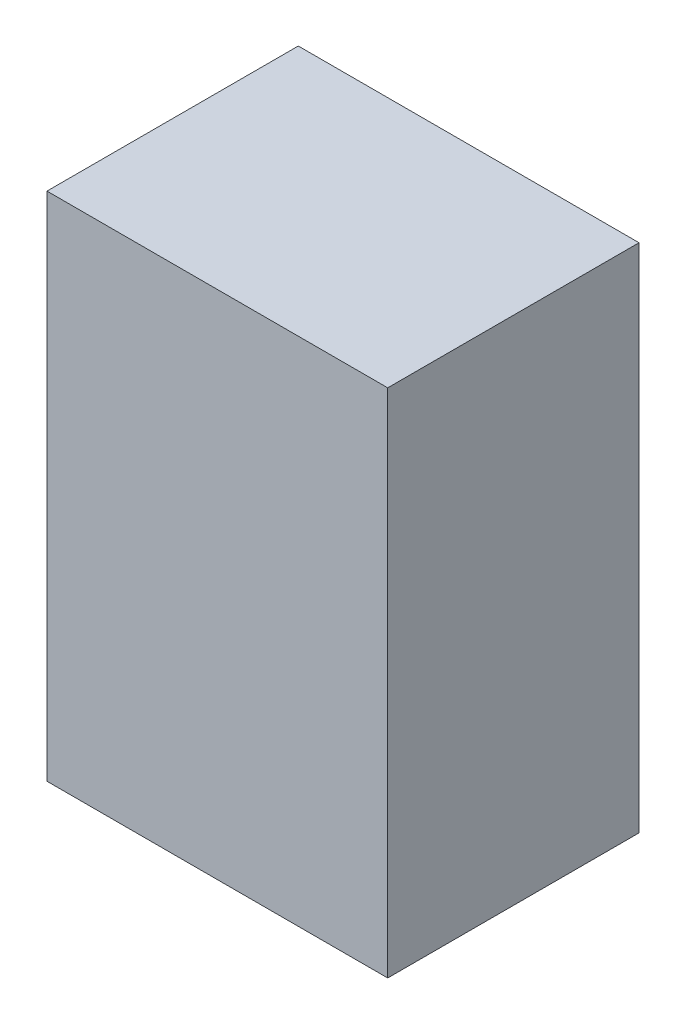
ISO-10303-21;
HEADER;
FILE_DESCRIPTION(('STEP AP214'),'2;1');
FILE_NAME('part.step','',(''),(''),'','','');
FILE_SCHEMA(('AUTOMOTIVE_DESIGN { 1 0 10303 214 1 1 1 1 }'));
ENDSEC;
DATA;
#1=APPLICATION_CONTEXT('core data for automotive mechanical design processes');
#2=APPLICATION_PROTOCOL_DEFINITION('international standard','automotive_design',2000,#1);
#3=PRODUCT_CONTEXT('',#1,'mechanical');
#4=PRODUCT('Part','Part','',(#3));
#5=PRODUCT_RELATED_PRODUCT_CATEGORY('part','',(#4));
#6=PRODUCT_DEFINITION_FORMATION('','',#4);
#7=PRODUCT_DEFINITION_CONTEXT('part definition',#1,'design');
#8=PRODUCT_DEFINITION('design','',#6,#7);
#9=PRODUCT_DEFINITION_SHAPE('','',#8);
#10=(LENGTH_UNIT() NAMED_UNIT(*) SI_UNIT(.MILLI.,.METRE.));
#11=(NAMED_UNIT(*) PLANE_ANGLE_UNIT() SI_UNIT($,.RADIAN.));
#12=(NAMED_UNIT(*) SI_UNIT($,.STERADIAN.) SOLID_ANGLE_UNIT());
#13=UNCERTAINTY_MEASURE_WITH_UNIT(LENGTH_MEASURE(1.E-05),#10,'distance_accuracy_value','');
#14=(GEOMETRIC_REPRESENTATION_CONTEXT(3) GLOBAL_UNCERTAINTY_ASSIGNED_CONTEXT((#13)) GLOBAL_UNIT_ASSIGNED_CONTEXT((#10,
#11,#12)) REPRESENTATION_CONTEXT('',''));
#15=CARTESIAN_POINT('',(0.,0.,0.));
#16=DIRECTION('',(0.,0.,1.));
#17=DIRECTION('',(1.,0.,0.));
#18=AXIS2_PLACEMENT_3D('',#15,#16,#17);
#19=CARTESIAN_POINT('',(-0.3999992,-0.5999988,0.58999882));
#20=DIRECTION('',(0.,0.,-1.));
#21=DIRECTION('',(-1.,0.,0.));
#22=AXIS2_PLACEMENT_3D('',#19,#20,#21);
#23=PLANE('',#22);
#24=DIRECTION('',(0.,1.,0.));
#25=VECTOR('',#24,1.);
#26=CARTESIAN_POINT('',(0.3999992,-0.5999988,0.58999882));
#27=LINE('',#26,#25);
#28=CARTESIAN_POINT('',(0.3999992,-0.5999988,0.58999882));
#29=VERTEX_POINT('',#28);
#30=CARTESIAN_POINT('',(0.3999992,0.60000134,0.58999882));
#31=VERTEX_POINT('',#30);
#32=EDGE_CURVE('E55',#29,#31,#27,.T.);
#33=ORIENTED_EDGE('',*,*,#32,.T.);
#34=DIRECTION('',(1.,0.,0.));
#35=VECTOR('',#34,1.);
#36=CARTESIAN_POINT('',(0.3999992,0.60000134,0.58999882));
#37=LINE('',#36,#35);
#38=CARTESIAN_POINT('',(-0.3999992,0.60000134,0.58999882));
#39=VERTEX_POINT('',#38);
#40=EDGE_CURVE('E57',#31,#39,#37,.F.);
#41=ORIENTED_EDGE('',*,*,#40,.T.);
#42=DIRECTION('',(0.,1.,0.));
#43=VECTOR('',#42,1.);
#44=CARTESIAN_POINT('',(-0.3999992,0.60000134,0.58999882));
#45=LINE('',#44,#43);
#46=CARTESIAN_POINT('',(-0.3999992,-0.5999988,0.58999882));
#47=VERTEX_POINT('',#46);
#48=EDGE_CURVE('E20',#39,#47,#45,.F.);
#49=ORIENTED_EDGE('',*,*,#48,.T.);
#50=DIRECTION('',(1.,0.,0.));
#51=VECTOR('',#50,1.);
#52=CARTESIAN_POINT('',(-0.3999992,-0.5999988,0.58999882));
#53=LINE('',#52,#51);
#54=EDGE_CURVE('E80',#47,#29,#53,.T.);
#55=ORIENTED_EDGE('',*,*,#54,.T.);
#56=EDGE_LOOP('',(#33,#41,#49,#55));
#57=FACE_BOUND('',#56,.T.);
#58=ADVANCED_FACE('F17',(#57),#23,.F.);
#59=CARTESIAN_POINT('',(-0.3999992,0.60000134,0.));
#60=DIRECTION('',(1.,0.,0.));
#61=DIRECTION('',(0.,0.,-1.));
#62=AXIS2_PLACEMENT_3D('',#59,#60,#61);
#63=PLANE('',#62);
#64=DIRECTION('',(0.,0.,1.));
#65=VECTOR('',#64,1.);
#66=CARTESIAN_POINT('',(-0.3999992,-0.5999988,0.));
#67=LINE('',#66,#65);
#68=CARTESIAN_POINT('',(-0.3999992,-0.5999988,0.));
#69=VERTEX_POINT('',#68);
#70=EDGE_CURVE('E68',#69,#47,#67,.T.);
#71=ORIENTED_EDGE('',*,*,#70,.T.);
#72=ORIENTED_EDGE('',*,*,#48,.F.);
#73=DIRECTION('',(0.,0.,-1.));
#74=VECTOR('',#73,1.);
#75=CARTESIAN_POINT('',(-0.3999992,0.60000134,0.));
#76=LINE('',#75,#74);
#77=CARTESIAN_POINT('',(-0.3999992,0.60000134,0.));
#78=VERTEX_POINT('',#77);
#79=EDGE_CURVE('E63',#39,#78,#76,.T.);
#80=ORIENTED_EDGE('',*,*,#79,.T.);
#81=DIRECTION('',(0.,1.,0.));
#82=VECTOR('',#81,1.);
#83=CARTESIAN_POINT('',(-0.3999992,-0.5999988,0.));
#84=LINE('',#83,#82);
#85=EDGE_CURVE('E83',#69,#78,#84,.T.);
#86=ORIENTED_EDGE('',*,*,#85,.F.);
#87=EDGE_LOOP('',(#71,#72,#80,#86));
#88=FACE_BOUND('',#87,.T.);
#89=ADVANCED_FACE('F65',(#88),#63,.F.);
#90=CARTESIAN_POINT('',(0.3999992,0.60000134,0.));
#91=DIRECTION('',(0.,-1.,0.));
#92=DIRECTION('',(0.,0.,-1.));
#93=AXIS2_PLACEMENT_3D('',#90,#91,#92);
#94=PLANE('',#93);
#95=ORIENTED_EDGE('',*,*,#79,.F.);
#96=ORIENTED_EDGE('',*,*,#40,.F.);
#97=DIRECTION('',(0.,0.,1.));
#98=VECTOR('',#97,1.);
#99=CARTESIAN_POINT('',(0.3999992,0.60000134,0.));
#100=LINE('',#99,#98);
#101=CARTESIAN_POINT('',(0.3999992,0.60000134,0.));
#102=VERTEX_POINT('',#101);
#103=EDGE_CURVE('E75',#31,#102,#100,.F.);
#104=ORIENTED_EDGE('',*,*,#103,.T.);
#105=DIRECTION('',(-1.,0.,0.));
#106=VECTOR('',#105,1.);
#107=CARTESIAN_POINT('',(-0.3999992,0.60000134,0.));
#108=LINE('',#107,#106);
#109=EDGE_CURVE('E72',#78,#102,#108,.F.);
#110=ORIENTED_EDGE('',*,*,#109,.F.);
#111=EDGE_LOOP('',(#95,#96,#104,#110));
#112=FACE_BOUND('',#111,.T.);
#113=ADVANCED_FACE('F70',(#112),#94,.F.);
#114=CARTESIAN_POINT('',(0.3999992,-0.5999988,0.));
#115=DIRECTION('',(-1.,0.,0.));
#116=DIRECTION('',(0.,0.,1.));
#117=AXIS2_PLACEMENT_3D('',#114,#115,#116);
#118=PLANE('',#117);
#119=ORIENTED_EDGE('',*,*,#103,.F.);
#120=ORIENTED_EDGE('',*,*,#32,.F.);
#121=DIRECTION('',(0.,0.,1.));
#122=VECTOR('',#121,1.);
#123=CARTESIAN_POINT('',(0.3999992,-0.5999988,0.));
#124=LINE('',#123,#122);
#125=CARTESIAN_POINT('',(0.3999992,-0.5999988,0.));
#126=VERTEX_POINT('',#125);
#127=EDGE_CURVE('E35',#29,#126,#124,.F.);
#128=ORIENTED_EDGE('',*,*,#127,.T.);
#129=DIRECTION('',(0.,1.,0.));
#130=VECTOR('',#129,1.);
#131=CARTESIAN_POINT('',(0.3999992,-0.5999988,0.));
#132=LINE('',#131,#130);
#133=EDGE_CURVE('E26',#102,#126,#132,.F.);
#134=ORIENTED_EDGE('',*,*,#133,.F.);
#135=EDGE_LOOP('',(#119,#120,#128,#134));
#136=FACE_BOUND('',#135,.T.);
#137=ADVANCED_FACE('F89',(#136),#118,.F.);
#138=CARTESIAN_POINT('',(-0.3999992,-0.5999988,0.));
#139=DIRECTION('',(0.,1.,0.));
#140=DIRECTION('',(0.,0.,1.));
#141=AXIS2_PLACEMENT_3D('',#138,#139,#140);
#142=PLANE('',#141);
#143=ORIENTED_EDGE('',*,*,#127,.F.);
#144=ORIENTED_EDGE('',*,*,#54,.F.);
#145=ORIENTED_EDGE('',*,*,#70,.F.);
#146=DIRECTION('',(-1.,0.,0.));
#147=VECTOR('',#146,1.);
#148=CARTESIAN_POINT('',(-0.3999992,-0.5999988,0.));
#149=LINE('',#148,#147);
#150=EDGE_CURVE('E11',#126,#69,#149,.T.);
#151=ORIENTED_EDGE('',*,*,#150,.F.);
#152=EDGE_LOOP('',(#143,#144,#145,#151));
#153=FACE_BOUND('',#152,.T.);
#154=ADVANCED_FACE('F91',(#153),#142,.F.);
#155=CARTESIAN_POINT('',(-0.3999992,-0.5999988,0.));
#156=DIRECTION('',(0.,0.,-1.));
#157=DIRECTION('',(-1.,0.,0.));
#158=AXIS2_PLACEMENT_3D('',#155,#156,#157);
#159=PLANE('',#158);
#160=ORIENTED_EDGE('',*,*,#133,.T.);
#161=ORIENTED_EDGE('',*,*,#150,.T.);
#162=ORIENTED_EDGE('',*,*,#85,.T.);
#163=ORIENTED_EDGE('',*,*,#109,.T.);
#164=EDGE_LOOP('',(#160,#161,#162,#163));
#165=FACE_BOUND('',#164,.T.);
#166=ADVANCED_FACE('F88',(#165),#159,.T.);
#167=CLOSED_SHELL('',(#58,#89,#113,#137,#154,#166));
#168=MANIFOLD_SOLID_BREP('B1',#167);
#169=ADVANCED_BREP_SHAPE_REPRESENTATION('',(#18,#168),#14);
#170=SHAPE_DEFINITION_REPRESENTATION(#9,#169);
ENDSEC;
END-ISO-10303-21;
